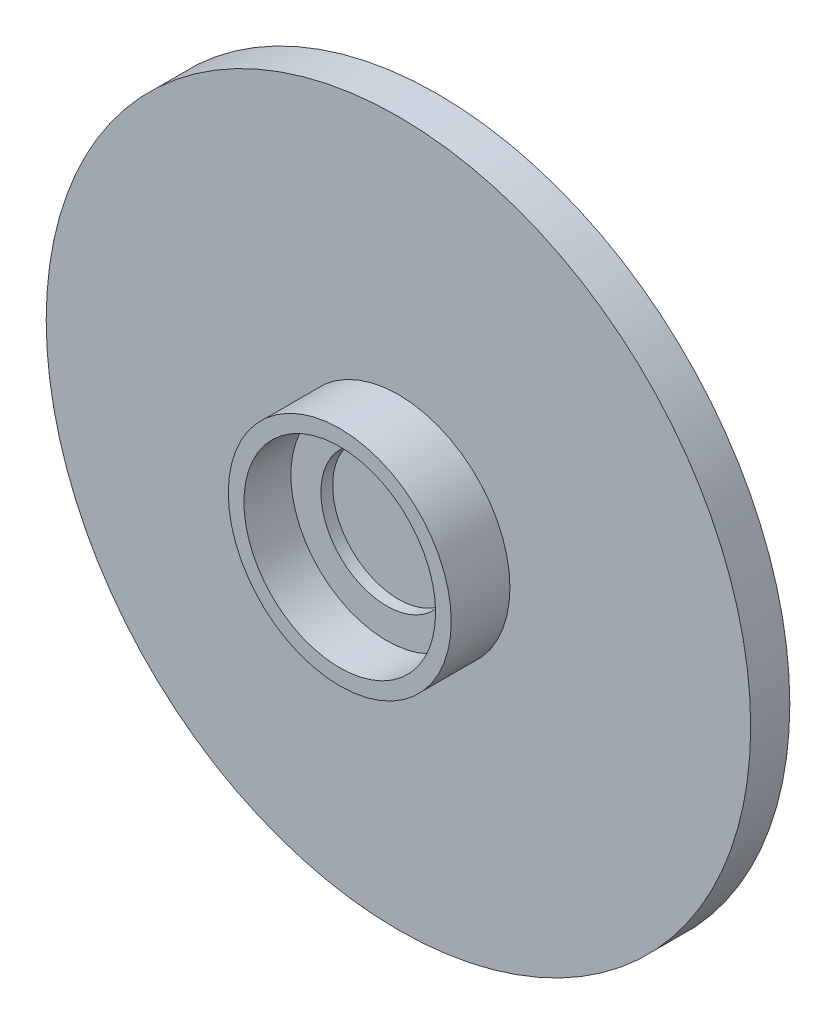
ISO-10303-21;
HEADER;
FILE_DESCRIPTION(('STEP AP214'),'2;1');
FILE_NAME('part.step','',(''),(''),'','','');
FILE_SCHEMA(('AUTOMOTIVE_DESIGN { 1 0 10303 214 1 1 1 1 }'));
ENDSEC;
DATA;
#1=APPLICATION_CONTEXT('core data for automotive mechanical design processes');
#2=APPLICATION_PROTOCOL_DEFINITION('international standard','automotive_design',2000,#1);
#3=PRODUCT_CONTEXT('',#1,'mechanical');
#4=PRODUCT('Part','Part','',(#3));
#5=PRODUCT_RELATED_PRODUCT_CATEGORY('part','',(#4));
#6=PRODUCT_DEFINITION_FORMATION('','',#4);
#7=PRODUCT_DEFINITION_CONTEXT('part definition',#1,'design');
#8=PRODUCT_DEFINITION('design','',#6,#7);
#9=PRODUCT_DEFINITION_SHAPE('','',#8);
#10=(LENGTH_UNIT() NAMED_UNIT(*) SI_UNIT(.MILLI.,.METRE.));
#11=(NAMED_UNIT(*) PLANE_ANGLE_UNIT() SI_UNIT($,.RADIAN.));
#12=(NAMED_UNIT(*) SI_UNIT($,.STERADIAN.) SOLID_ANGLE_UNIT());
#13=UNCERTAINTY_MEASURE_WITH_UNIT(LENGTH_MEASURE(1.E-05),#10,'distance_accuracy_value','');
#14=(GEOMETRIC_REPRESENTATION_CONTEXT(3) GLOBAL_UNCERTAINTY_ASSIGNED_CONTEXT((#13)) GLOBAL_UNIT_ASSIGNED_CONTEXT((#10,
#11,#12)) REPRESENTATION_CONTEXT('',''));
#15=CARTESIAN_POINT('',(0.,0.,0.));
#16=DIRECTION('',(0.,0.,1.));
#17=DIRECTION('',(1.,0.,0.));
#18=AXIS2_PLACEMENT_3D('',#15,#16,#17);
#19=CARTESIAN_POINT('',(0.,0.,0.));
#20=DIRECTION('',(0.,0.,1.));
#21=DIRECTION('',(1.,0.,0.));
#22=AXIS2_PLACEMENT_3D('',#19,#20,#21);
#23=PLANE('',#22);
#24=DIRECTION('',(0.,1.,0.));
#25=VECTOR('',#24,1.);
#26=CARTESIAN_POINT('',(-15.,-15.5757504538201,0.));
#27=LINE('',#26,#25);
#28=CARTESIAN_POINT('',(-15.,-20.2068950823154,0.));
#29=VERTEX_POINT('',#28);
#30=CARTESIAN_POINT('',(-15.,-15.5757504538201,0.));
#31=VERTEX_POINT('',#30);
#32=EDGE_CURVE('E215',#29,#31,#27,.T.);
#33=ORIENTED_EDGE('',*,*,#32,.T.);
#34=DIRECTION('',(-1.,0.,0.));
#35=VECTOR('',#34,1.);
#36=CARTESIAN_POINT('',(-15.,-15.5757504538201,0.));
#37=LINE('',#36,#35);
#38=CARTESIAN_POINT('',(-20.,-15.5757504538201,0.));
#39=VERTEX_POINT('',#38);
#40=EDGE_CURVE('E162',#31,#39,#37,.T.);
#41=ORIENTED_EDGE('',*,*,#40,.T.);
#42=DIRECTION('',(0.,1.,0.));
#43=VECTOR('',#42,1.);
#44=CARTESIAN_POINT('',(-20.,-15.5757504538201,0.));
#45=LINE('',#44,#43);
#46=CARTESIAN_POINT('',(-20.,-20.2068950823154,0.));
#47=VERTEX_POINT('',#46);
#48=EDGE_CURVE('E247',#47,#39,#45,.T.);
#49=ORIENTED_EDGE('',*,*,#48,.F.);
#50=DIRECTION('',(-1.,0.,0.));
#51=VECTOR('',#50,1.);
#52=CARTESIAN_POINT('',(-15.,-20.2068950823154,0.));
#53=LINE('',#52,#51);
#54=EDGE_CURVE('E252',#29,#47,#53,.T.);
#55=ORIENTED_EDGE('',*,*,#54,.F.);
#56=EDGE_LOOP('',(#33,#41,#49,#55));
#57=FACE_BOUND('',#56,.T.);
#58=CARTESIAN_POINT('',(0.,0.,0.));
#59=DIRECTION('',(0.,0.,1.));
#60=DIRECTION('',(1.,0.,0.));
#61=AXIS2_PLACEMENT_3D('',#58,#59,#60);
#62=CIRCLE('',#61,90.043);
#63=CARTESIAN_POINT('',(90.043,0.,0.));
#64=VERTEX_POINT('',#63);
#65=EDGE_CURVE('E181',#64,#64,#62,.T.);
#66=ORIENTED_EDGE('',*,*,#65,.F.);
#67=EDGE_LOOP('',(#66));
#68=FACE_BOUND('',#67,.T.);
#69=DIRECTION('',(0.,-1.,0.));
#70=VECTOR('',#69,1.);
#71=CARTESIAN_POINT('',(20.,-45.,0.));
#72=LINE('',#71,#70);
#73=CARTESIAN_POINT('',(20.,-35.,0.));
#74=VERTEX_POINT('',#73);
#75=CARTESIAN_POINT('',(20.,-45.,0.));
#76=VERTEX_POINT('',#75);
#77=EDGE_CURVE('E158',#74,#76,#72,.T.);
#78=ORIENTED_EDGE('',*,*,#77,.F.);
#79=DIRECTION('',(1.,0.,0.));
#80=VECTOR('',#79,1.);
#81=CARTESIAN_POINT('',(20.,-35.,0.));
#82=LINE('',#81,#80);
#83=CARTESIAN_POINT('',(-20.,-35.,0.));
#84=VERTEX_POINT('',#83);
#85=EDGE_CURVE('E168',#84,#74,#82,.T.);
#86=ORIENTED_EDGE('',*,*,#85,.F.);
#87=DIRECTION('',(0.,1.,0.));
#88=VECTOR('',#87,1.);
#89=CARTESIAN_POINT('',(-20.,-45.,0.));
#90=LINE('',#89,#88);
#91=CARTESIAN_POINT('',(-20.,-45.,0.));
#92=VERTEX_POINT('',#91);
#93=EDGE_CURVE('E165',#92,#84,#90,.T.);
#94=ORIENTED_EDGE('',*,*,#93,.F.);
#95=DIRECTION('',(-1.,0.,0.));
#96=VECTOR('',#95,1.);
#97=CARTESIAN_POINT('',(20.,-45.,0.));
#98=LINE('',#97,#96);
#99=EDGE_CURVE('E161',#76,#92,#98,.T.);
#100=ORIENTED_EDGE('',*,*,#99,.F.);
#101=EDGE_LOOP('',(#78,#86,#94,#100));
#102=FACE_BOUND('',#101,.T.);
#103=DIRECTION('',(0.,1.,0.));
#104=VECTOR('',#103,1.);
#105=CARTESIAN_POINT('',(15.,-15.5757504538201,0.));
#106=LINE('',#105,#104);
#107=CARTESIAN_POINT('',(15.,-20.2068950823154,0.));
#108=VERTEX_POINT('',#107);
#109=CARTESIAN_POINT('',(15.,-15.5757504538201,0.));
#110=VERTEX_POINT('',#109);
#111=EDGE_CURVE('E124',#108,#110,#106,.T.);
#112=ORIENTED_EDGE('',*,*,#111,.F.);
#113=DIRECTION('',(1.,0.,0.));
#114=VECTOR('',#113,1.);
#115=CARTESIAN_POINT('',(15.,-20.2068950823154,0.));
#116=LINE('',#115,#114);
#117=CARTESIAN_POINT('',(20.,-20.2068950823154,0.));
#118=VERTEX_POINT('',#117);
#119=EDGE_CURVE('E224',#108,#118,#116,.T.);
#120=ORIENTED_EDGE('',*,*,#119,.T.);
#121=DIRECTION('',(0.,1.,0.));
#122=VECTOR('',#121,1.);
#123=CARTESIAN_POINT('',(20.,-15.5757504538201,0.));
#124=LINE('',#123,#122);
#125=CARTESIAN_POINT('',(20.,-15.5757504538201,0.));
#126=VERTEX_POINT('',#125);
#127=EDGE_CURVE('E229',#118,#126,#124,.T.);
#128=ORIENTED_EDGE('',*,*,#127,.T.);
#129=DIRECTION('',(1.,0.,0.));
#130=VECTOR('',#129,1.);
#131=CARTESIAN_POINT('',(15.,-15.5757504538201,0.));
#132=LINE('',#131,#130);
#133=EDGE_CURVE('E134',#110,#126,#132,.T.);
#134=ORIENTED_EDGE('',*,*,#133,.F.);
#135=EDGE_LOOP('',(#112,#120,#128,#134));
#136=FACE_BOUND('',#135,.T.);
#137=ADVANCED_FACE('F33',(#57,#68,#102,#136),#23,.F.);
#138=CARTESIAN_POINT('',(20.,-35.,-40.));
#139=DIRECTION('',(0.,-1.,0.));
#140=DIRECTION('',(0.,0.,-1.));
#141=AXIS2_PLACEMENT_3D('',#138,#139,#140);
#142=PLANE('',#141);
#143=DIRECTION('',(1.,0.,0.));
#144=VECTOR('',#143,1.);
#145=CARTESIAN_POINT('',(15.,-35.,-30.4631690043209));
#146=LINE('',#145,#144);
#147=CARTESIAN_POINT('',(15.,-35.,-30.4631690043209));
#148=VERTEX_POINT('',#147);
#149=CARTESIAN_POINT('',(20.,-35.,-30.4631690043209));
#150=VERTEX_POINT('',#149);
#151=EDGE_CURVE('E145',#148,#150,#146,.T.);
#152=ORIENTED_EDGE('',*,*,#151,.F.);
#153=DIRECTION('',(0.,0.,1.));
#154=VECTOR('',#153,1.);
#155=CARTESIAN_POINT('',(15.,-35.,-30.4631690043209));
#156=LINE('',#155,#154);
#157=CARTESIAN_POINT('',(15.,-35.,-40.));
#158=VERTEX_POINT('',#157);
#159=EDGE_CURVE('E121',#158,#148,#156,.T.);
#160=ORIENTED_EDGE('',*,*,#159,.F.);
#161=DIRECTION('',(1.,0.,0.));
#162=VECTOR('',#161,1.);
#163=CARTESIAN_POINT('',(20.,-35.,-40.));
#164=LINE('',#163,#162);
#165=CARTESIAN_POINT('',(-15.,-35.,-40.));
#166=VERTEX_POINT('',#165);
#167=EDGE_CURVE('E141',#166,#158,#164,.T.);
#168=ORIENTED_EDGE('',*,*,#167,.F.);
#169=DIRECTION('',(0.,0.,1.));
#170=VECTOR('',#169,1.);
#171=CARTESIAN_POINT('',(-15.,-35.,-30.4631690043209));
#172=LINE('',#171,#170);
#173=CARTESIAN_POINT('',(-15.,-35.,-30.4631690043209));
#174=VERTEX_POINT('',#173);
#175=EDGE_CURVE('E236',#166,#174,#172,.T.);
#176=ORIENTED_EDGE('',*,*,#175,.T.);
#177=DIRECTION('',(-1.,0.,0.));
#178=VECTOR('',#177,1.);
#179=CARTESIAN_POINT('',(-15.,-35.,-30.4631690043209));
#180=LINE('',#179,#178);
#181=CARTESIAN_POINT('',(-20.,-35.,-30.4631690043209));
#182=VERTEX_POINT('',#181);
#183=EDGE_CURVE('E245',#174,#182,#180,.T.);
#184=ORIENTED_EDGE('',*,*,#183,.T.);
#185=DIRECTION('',(0.,0.,1.));
#186=VECTOR('',#185,1.);
#187=CARTESIAN_POINT('',(-20.,-35.,-40.));
#188=LINE('',#187,#186);
#189=EDGE_CURVE('E173',#182,#84,#188,.T.);
#190=ORIENTED_EDGE('',*,*,#189,.T.);
#191=ORIENTED_EDGE('',*,*,#85,.T.);
#192=DIRECTION('',(0.,0.,1.));
#193=VECTOR('',#192,1.);
#194=CARTESIAN_POINT('',(20.,-35.,-40.));
#195=LINE('',#194,#193);
#196=EDGE_CURVE('E153',#150,#74,#195,.T.);
#197=ORIENTED_EDGE('',*,*,#196,.F.);
#198=EDGE_LOOP('',(#152,#160,#168,#176,#184,#190,#191,#197));
#199=FACE_BOUND('',#198,.T.);
#200=ADVANCED_FACE('F139',(#199),#142,.F.);
#201=CARTESIAN_POINT('',(0.,0.,10.));
#202=DIRECTION('',(0.,0.,-1.));
#203=DIRECTION('',(-1.,0.,0.));
#204=AXIS2_PLACEMENT_3D('',#201,#202,#203);
#205=CYLINDRICAL_SURFACE('',#204,90.043);
#206=CARTESIAN_POINT('',(0.,0.,10.));
#207=DIRECTION('',(0.,0.,1.));
#208=DIRECTION('',(1.,0.,0.));
#209=AXIS2_PLACEMENT_3D('',#206,#207,#208);
#210=CIRCLE('',#209,90.043);
#211=CARTESIAN_POINT('',(90.043,0.,10.));
#212=VERTEX_POINT('',#211);
#213=EDGE_CURVE('E182',#212,#212,#210,.T.);
#214=ORIENTED_EDGE('',*,*,#213,.F.);
#215=EDGE_LOOP('',(#214));
#216=FACE_BOUND('',#215,.T.);
#217=ORIENTED_EDGE('',*,*,#65,.T.);
#218=EDGE_LOOP('',(#217));
#219=FACE_BOUND('',#218,.T.);
#220=ADVANCED_FACE('F35',(#216,#219),#205,.T.);
#221=CARTESIAN_POINT('',(0.,0.,10.));
#222=DIRECTION('',(0.,0.,1.));
#223=DIRECTION('',(1.,0.,0.));
#224=AXIS2_PLACEMENT_3D('',#221,#222,#223);
#225=PLANE('',#224);
#226=CARTESIAN_POINT('',(0.,0.,10.));
#227=DIRECTION('',(0.,0.,1.));
#228=DIRECTION('',(1.,0.,0.));
#229=AXIS2_PLACEMENT_3D('',#226,#227,#228);
#230=CIRCLE('',#229,28.5);
#231=CARTESIAN_POINT('',(28.5,0.,10.));
#232=VERTEX_POINT('',#231);
#233=EDGE_CURVE('E441',#232,#232,#230,.T.);
#234=ORIENTED_EDGE('',*,*,#233,.F.);
#235=EDGE_LOOP('',(#234));
#236=FACE_BOUND('',#235,.T.);
#237=ORIENTED_EDGE('',*,*,#213,.T.);
#238=EDGE_LOOP('',(#237));
#239=FACE_BOUND('',#238,.T.);
#240=ADVANCED_FACE('F194',(#236,#239),#225,.T.);
#241=CARTESIAN_POINT('',(20.,-45.,-40.));
#242=DIRECTION('',(-1.,0.,0.));
#243=DIRECTION('',(0.,0.,1.));
#244=AXIS2_PLACEMENT_3D('',#241,#242,#243);
#245=PLANE('',#244);
#246=ORIENTED_EDGE('',*,*,#77,.T.);
#247=DIRECTION('',(0.,0.,1.));
#248=VECTOR('',#247,1.);
#249=CARTESIAN_POINT('',(20.,-45.,-40.));
#250=LINE('',#249,#248);
#251=CARTESIAN_POINT('',(20.,-45.,-40.));
#252=VERTEX_POINT('',#251);
#253=EDGE_CURVE('E178',#252,#76,#250,.T.);
#254=ORIENTED_EDGE('',*,*,#253,.F.);
#255=DIRECTION('',(0.,-1.,0.));
#256=VECTOR('',#255,1.);
#257=CARTESIAN_POINT('',(20.,-45.,-40.));
#258=LINE('',#257,#256);
#259=CARTESIAN_POINT('',(20.,-35.,-40.));
#260=VERTEX_POINT('',#259);
#261=EDGE_CURVE('E171',#260,#252,#258,.T.);
#262=ORIENTED_EDGE('',*,*,#261,.F.);
#263=DIRECTION('',(0.,-0.436825320486211,-0.899546351992002));
#264=VECTOR('',#263,1.);
#265=CARTESIAN_POINT('',(20.,-35.,-40.));
#266=LINE('',#265,#264);
#267=EDGE_CURVE('E48',#126,#260,#266,.T.);
#268=ORIENTED_EDGE('',*,*,#267,.F.);
#269=ORIENTED_EDGE('',*,*,#127,.F.);
#270=DIRECTION('',(0.,0.436825320486211,0.899546351992002));
#271=VECTOR('',#270,1.);
#272=CARTESIAN_POINT('',(20.,-20.2068950823154,0.));
#273=LINE('',#272,#271);
#274=EDGE_CURVE('E146',#150,#118,#273,.T.);
#275=ORIENTED_EDGE('',*,*,#274,.F.);
#276=ORIENTED_EDGE('',*,*,#196,.T.);
#277=EDGE_LOOP('',(#246,#254,#262,#268,#269,#275,#276));
#278=FACE_BOUND('',#277,.T.);
#279=ADVANCED_FACE('F203',(#278),#245,.F.);
#280=CARTESIAN_POINT('',(20.,-45.,-40.));
#281=DIRECTION('',(0.,1.,0.));
#282=DIRECTION('',(0.,0.,1.));
#283=AXIS2_PLACEMENT_3D('',#280,#281,#282);
#284=PLANE('',#283);
#285=ORIENTED_EDGE('',*,*,#99,.T.);
#286=DIRECTION('',(0.,0.,1.));
#287=VECTOR('',#286,1.);
#288=CARTESIAN_POINT('',(-20.,-45.,-40.));
#289=LINE('',#288,#287);
#290=CARTESIAN_POINT('',(-20.,-45.,-40.));
#291=VERTEX_POINT('',#290);
#292=EDGE_CURVE('E175',#291,#92,#289,.T.);
#293=ORIENTED_EDGE('',*,*,#292,.F.);
#294=DIRECTION('',(-1.,0.,0.));
#295=VECTOR('',#294,1.);
#296=CARTESIAN_POINT('',(20.,-45.,-40.));
#297=LINE('',#296,#295);
#298=EDGE_CURVE('E154',#252,#291,#297,.T.);
#299=ORIENTED_EDGE('',*,*,#298,.F.);
#300=ORIENTED_EDGE('',*,*,#253,.T.);
#301=EDGE_LOOP('',(#285,#293,#299,#300));
#302=FACE_BOUND('',#301,.T.);
#303=ADVANCED_FACE('F260',(#302),#284,.F.);
#304=CARTESIAN_POINT('',(-20.,-45.,-40.));
#305=DIRECTION('',(1.,0.,0.));
#306=DIRECTION('',(0.,0.,-1.));
#307=AXIS2_PLACEMENT_3D('',#304,#305,#306);
#308=PLANE('',#307);
#309=ORIENTED_EDGE('',*,*,#93,.T.);
#310=ORIENTED_EDGE('',*,*,#189,.F.);
#311=DIRECTION('',(0.,0.436825320486211,0.899546351992002));
#312=VECTOR('',#311,1.);
#313=CARTESIAN_POINT('',(-20.,-20.2068950823154,0.));
#314=LINE('',#313,#312);
#315=EDGE_CURVE('E56',#182,#47,#314,.T.);
#316=ORIENTED_EDGE('',*,*,#315,.T.);
#317=ORIENTED_EDGE('',*,*,#48,.T.);
#318=DIRECTION('',(0.,-0.436825320486211,-0.899546351992002));
#319=VECTOR('',#318,1.);
#320=CARTESIAN_POINT('',(-20.,-35.,-40.));
#321=LINE('',#320,#319);
#322=CARTESIAN_POINT('',(-20.,-35.,-40.));
#323=VERTEX_POINT('',#322);
#324=EDGE_CURVE('E239',#39,#323,#321,.T.);
#325=ORIENTED_EDGE('',*,*,#324,.T.);
#326=DIRECTION('',(0.,1.,0.));
#327=VECTOR('',#326,1.);
#328=CARTESIAN_POINT('',(-20.,-45.,-40.));
#329=LINE('',#328,#327);
#330=EDGE_CURVE('E151',#291,#323,#329,.T.);
#331=ORIENTED_EDGE('',*,*,#330,.F.);
#332=ORIENTED_EDGE('',*,*,#292,.T.);
#333=EDGE_LOOP('',(#309,#310,#316,#317,#325,#331,#332));
#334=FACE_BOUND('',#333,.T.);
#335=ADVANCED_FACE('F261',(#334),#308,.F.);
#336=CARTESIAN_POINT('',(0.,0.,-40.));
#337=DIRECTION('',(0.,0.,1.));
#338=DIRECTION('',(1.,0.,0.));
#339=AXIS2_PLACEMENT_3D('',#336,#337,#338);
#340=PLANE('',#339);
#341=ORIENTED_EDGE('',*,*,#261,.T.);
#342=ORIENTED_EDGE('',*,*,#298,.T.);
#343=ORIENTED_EDGE('',*,*,#330,.T.);
#344=EDGE_CURVE('E150',#323,#166,#164,.T.);
#345=ORIENTED_EDGE('',*,*,#344,.T.);
#346=ORIENTED_EDGE('',*,*,#167,.T.);
#347=DIRECTION('',(1.,0.,0.));
#348=VECTOR('',#347,1.);
#349=CARTESIAN_POINT('',(15.,-35.,-40.));
#350=LINE('',#349,#348);
#351=EDGE_CURVE('E129',#158,#260,#350,.T.);
#352=ORIENTED_EDGE('',*,*,#351,.T.);
#353=EDGE_LOOP('',(#341,#342,#343,#345,#346,#352));
#354=FACE_BOUND('',#353,.T.);
#355=ADVANCED_FACE('F148',(#354),#340,.F.);
#356=CARTESIAN_POINT('',(-15.,-35.,-40.));
#357=DIRECTION('',(0.,0.899546351992002,-0.436825320486211));
#358=DIRECTION('',(0.,0.436825320486211,0.899546351992002));
#359=AXIS2_PLACEMENT_3D('',#356,#357,#358);
#360=PLANE('',#359);
#361=ORIENTED_EDGE('',*,*,#324,.F.);
#362=ORIENTED_EDGE('',*,*,#40,.F.);
#363=DIRECTION('',(0.,-0.436825320486211,-0.899546351992002));
#364=VECTOR('',#363,1.);
#365=CARTESIAN_POINT('',(-15.,-35.,-40.));
#366=LINE('',#365,#364);
#367=EDGE_CURVE('E243',#31,#166,#366,.T.);
#368=ORIENTED_EDGE('',*,*,#367,.T.);
#369=ORIENTED_EDGE('',*,*,#344,.F.);
#370=EDGE_LOOP('',(#361,#362,#368,#369));
#371=FACE_BOUND('',#370,.T.);
#372=ADVANCED_FACE('F265',(#371),#360,.T.);
#373=CARTESIAN_POINT('',(-15.,-20.2068950823154,0.));
#374=DIRECTION('',(0.,-0.899546351992002,0.436825320486211));
#375=DIRECTION('',(0.,-0.436825320486211,-0.899546351992002));
#376=AXIS2_PLACEMENT_3D('',#373,#374,#375);
#377=PLANE('',#376);
#378=ORIENTED_EDGE('',*,*,#315,.F.);
#379=ORIENTED_EDGE('',*,*,#183,.F.);
#380=DIRECTION('',(0.,0.436825320486211,0.899546351992002));
#381=VECTOR('',#380,1.);
#382=CARTESIAN_POINT('',(-15.,-20.2068950823154,0.));
#383=LINE('',#382,#381);
#384=EDGE_CURVE('E238',#174,#29,#383,.T.);
#385=ORIENTED_EDGE('',*,*,#384,.T.);
#386=ORIENTED_EDGE('',*,*,#54,.T.);
#387=EDGE_LOOP('',(#378,#379,#385,#386));
#388=FACE_BOUND('',#387,.T.);
#389=ADVANCED_FACE('F268',(#388),#377,.T.);
#390=CARTESIAN_POINT('',(-15.,0.,0.));
#391=DIRECTION('',(-1.,0.,0.));
#392=DIRECTION('',(0.,0.,1.));
#393=AXIS2_PLACEMENT_3D('',#390,#391,#392);
#394=PLANE('',#393);
#395=ORIENTED_EDGE('',*,*,#175,.F.);
#396=ORIENTED_EDGE('',*,*,#367,.F.);
#397=ORIENTED_EDGE('',*,*,#32,.F.);
#398=ORIENTED_EDGE('',*,*,#384,.F.);
#399=EDGE_LOOP('',(#395,#396,#397,#398));
#400=FACE_BOUND('',#399,.T.);
#401=ADVANCED_FACE('F272',(#400),#394,.F.);
#402=CARTESIAN_POINT('',(15.,-20.2068950823154,0.));
#403=DIRECTION('',(0.,0.899546351992002,-0.436825320486211));
#404=DIRECTION('',(0.,0.436825320486211,0.899546351992002));
#405=AXIS2_PLACEMENT_3D('',#402,#403,#404);
#406=PLANE('',#405);
#407=ORIENTED_EDGE('',*,*,#274,.T.);
#408=ORIENTED_EDGE('',*,*,#119,.F.);
#409=DIRECTION('',(0.,0.436825320486211,0.899546351992002));
#410=VECTOR('',#409,1.);
#411=CARTESIAN_POINT('',(15.,-20.2068950823154,0.));
#412=LINE('',#411,#410);
#413=EDGE_CURVE('E135',#148,#108,#412,.T.);
#414=ORIENTED_EDGE('',*,*,#413,.F.);
#415=ORIENTED_EDGE('',*,*,#151,.T.);
#416=EDGE_LOOP('',(#407,#408,#414,#415));
#417=FACE_BOUND('',#416,.T.);
#418=ADVANCED_FACE('F274',(#417),#406,.F.);
#419=CARTESIAN_POINT('',(15.,-35.,-40.));
#420=DIRECTION('',(0.,-0.899546351992002,0.436825320486211));
#421=DIRECTION('',(0.,-0.436825320486211,-0.899546351992002));
#422=AXIS2_PLACEMENT_3D('',#419,#420,#421);
#423=PLANE('',#422);
#424=ORIENTED_EDGE('',*,*,#267,.T.);
#425=ORIENTED_EDGE('',*,*,#351,.F.);
#426=DIRECTION('',(0.,-0.436825320486211,-0.899546351992002));
#427=VECTOR('',#426,1.);
#428=CARTESIAN_POINT('',(15.,-35.,-40.));
#429=LINE('',#428,#427);
#430=EDGE_CURVE('E117',#110,#158,#429,.T.);
#431=ORIENTED_EDGE('',*,*,#430,.F.);
#432=ORIENTED_EDGE('',*,*,#133,.T.);
#433=EDGE_LOOP('',(#424,#425,#431,#432));
#434=FACE_BOUND('',#433,.T.);
#435=ADVANCED_FACE('F130',(#434),#423,.F.);
#436=CARTESIAN_POINT('',(15.,0.,0.));
#437=DIRECTION('',(1.,0.,0.));
#438=DIRECTION('',(0.,0.,1.));
#439=AXIS2_PLACEMENT_3D('',#436,#437,#438);
#440=PLANE('',#439);
#441=ORIENTED_EDGE('',*,*,#159,.T.);
#442=ORIENTED_EDGE('',*,*,#413,.T.);
#443=ORIENTED_EDGE('',*,*,#111,.T.);
#444=ORIENTED_EDGE('',*,*,#430,.T.);
#445=EDGE_LOOP('',(#441,#442,#443,#444));
#446=FACE_BOUND('',#445,.T.);
#447=ADVANCED_FACE('F119',(#446),#440,.F.);
#448=CARTESIAN_POINT('',(0.,0.,25.));
#449=DIRECTION('',(0.,0.,1.));
#450=DIRECTION('',(1.,0.,0.));
#451=AXIS2_PLACEMENT_3D('',#448,#449,#450);
#452=PLANE('',#451);
#453=CARTESIAN_POINT('',(0.,0.,25.));
#454=DIRECTION('',(0.,0.,1.));
#455=DIRECTION('',(1.,0.,0.));
#456=AXIS2_PLACEMENT_3D('',#453,#454,#455);
#457=CIRCLE('',#456,28.5);
#458=CARTESIAN_POINT('',(28.5,0.,25.));
#459=VERTEX_POINT('',#458);
#460=EDGE_CURVE('E230',#459,#459,#457,.T.);
#461=ORIENTED_EDGE('',*,*,#460,.T.);
#462=EDGE_LOOP('',(#461));
#463=FACE_BOUND('',#462,.T.);
#464=CARTESIAN_POINT('',(0.,0.,25.));
#465=DIRECTION('',(0.,0.,1.));
#466=DIRECTION('',(1.,0.,0.));
#467=AXIS2_PLACEMENT_3D('',#464,#465,#466);
#468=CIRCLE('',#467,24.5);
#469=CARTESIAN_POINT('',(24.5,0.,25.));
#470=VERTEX_POINT('',#469);
#471=EDGE_CURVE('E438',#470,#470,#468,.T.);
#472=ORIENTED_EDGE('',*,*,#471,.F.);
#473=EDGE_LOOP('',(#472));
#474=FACE_BOUND('',#473,.T.);
#475=ADVANCED_FACE('F384',(#463,#474),#452,.T.);
#476=CARTESIAN_POINT('',(0.,0.,25.));
#477=DIRECTION('',(0.,0.,-1.));
#478=DIRECTION('',(-1.,0.,0.));
#479=AXIS2_PLACEMENT_3D('',#476,#477,#478);
#480=CYLINDRICAL_SURFACE('',#479,28.5);
#481=ORIENTED_EDGE('',*,*,#460,.F.);
#482=EDGE_LOOP('',(#481));
#483=FACE_BOUND('',#482,.T.);
#484=ORIENTED_EDGE('',*,*,#233,.T.);
#485=EDGE_LOOP('',(#484));
#486=FACE_BOUND('',#485,.T.);
#487=ADVANCED_FACE('F390',(#483,#486),#480,.T.);
#488=CARTESIAN_POINT('',(0.,0.,25.));
#489=DIRECTION('',(0.,0.,-1.));
#490=DIRECTION('',(-1.,0.,0.));
#491=AXIS2_PLACEMENT_3D('',#488,#489,#490);
#492=CYLINDRICAL_SURFACE('',#491,24.5);
#493=CARTESIAN_POINT('',(0.,0.,13.));
#494=DIRECTION('',(0.,0.,1.));
#495=DIRECTION('',(1.,0.,0.));
#496=AXIS2_PLACEMENT_3D('',#493,#494,#495);
#497=CIRCLE('',#496,24.5);
#498=CARTESIAN_POINT('',(24.5,0.,13.));
#499=VERTEX_POINT('',#498);
#500=EDGE_CURVE('E11',#499,#499,#497,.T.);
#501=ORIENTED_EDGE('',*,*,#500,.F.);
#502=EDGE_LOOP('',(#501));
#503=FACE_BOUND('',#502,.T.);
#504=ORIENTED_EDGE('',*,*,#471,.T.);
#505=EDGE_LOOP('',(#504));
#506=FACE_BOUND('',#505,.T.);
#507=ADVANCED_FACE('F399',(#503,#506),#492,.F.);
#508=CARTESIAN_POINT('',(0.,0.,13.));
#509=DIRECTION('',(0.,0.,1.));
#510=DIRECTION('',(1.,0.,0.));
#511=AXIS2_PLACEMENT_3D('',#508,#509,#510);
#512=PLANE('',#511);
#513=ORIENTED_EDGE('',*,*,#500,.T.);
#514=EDGE_LOOP('',(#513));
#515=FACE_BOUND('',#514,.T.);
#516=CARTESIAN_POINT('',(0.,0.,13.));
#517=DIRECTION('',(0.,0.,1.));
#518=DIRECTION('',(1.,0.,0.));
#519=AXIS2_PLACEMENT_3D('',#516,#517,#518);
#520=CIRCLE('',#519,16.8216573133233);
#521=CARTESIAN_POINT('',(16.8216573133233,0.,13.));
#522=VERTEX_POINT('',#521);
#523=EDGE_CURVE('E437',#522,#522,#520,.T.);
#524=ORIENTED_EDGE('',*,*,#523,.F.);
#525=EDGE_LOOP('',(#524));
#526=FACE_BOUND('',#525,.T.);
#527=ADVANCED_FACE('F198',(#515,#526),#512,.T.);
#528=CARTESIAN_POINT('',(0.,0.,13.));
#529=DIRECTION('',(0.,0.,-1.));
#530=DIRECTION('',(-1.,0.,0.));
#531=AXIS2_PLACEMENT_3D('',#528,#529,#530);
#532=CYLINDRICAL_SURFACE('',#531,16.8216573133233);
#533=ORIENTED_EDGE('',*,*,#523,.T.);
#534=EDGE_LOOP('',(#533));
#535=FACE_BOUND('',#534,.T.);
#536=CARTESIAN_POINT('',(0.,0.,10.));
#537=DIRECTION('',(0.,0.,1.));
#538=DIRECTION('',(1.,0.,0.));
#539=AXIS2_PLACEMENT_3D('',#536,#537,#538);
#540=CIRCLE('',#539,16.8216573133233);
#541=CARTESIAN_POINT('',(16.8216573133233,0.,10.));
#542=VERTEX_POINT('',#541);
#543=EDGE_CURVE('E41',#542,#542,#540,.F.);
#544=ORIENTED_EDGE('',*,*,#543,.T.);
#545=EDGE_LOOP('',(#544));
#546=FACE_BOUND('',#545,.T.);
#547=ADVANCED_FACE('F189',(#535,#546),#532,.F.);
#548=ORIENTED_EDGE('',*,*,#543,.F.);
#549=EDGE_LOOP('',(#548));
#550=FACE_BOUND('',#549,.T.);
#551=ADVANCED_FACE('F191',(#550),#225,.T.);
#552=CLOSED_SHELL('',(#137,#200,#220,#240,#279,#303,#335,#355,#372,#389,#401,#418,#435,#447,
#475,#487,#507,#527,#547,#551));
#553=MANIFOLD_SOLID_BREP('B2',#552);
#554=ADVANCED_BREP_SHAPE_REPRESENTATION('',(#18,#553),#14);
#555=SHAPE_DEFINITION_REPRESENTATION(#9,#554);
ENDSEC;
END-ISO-10303-21;
